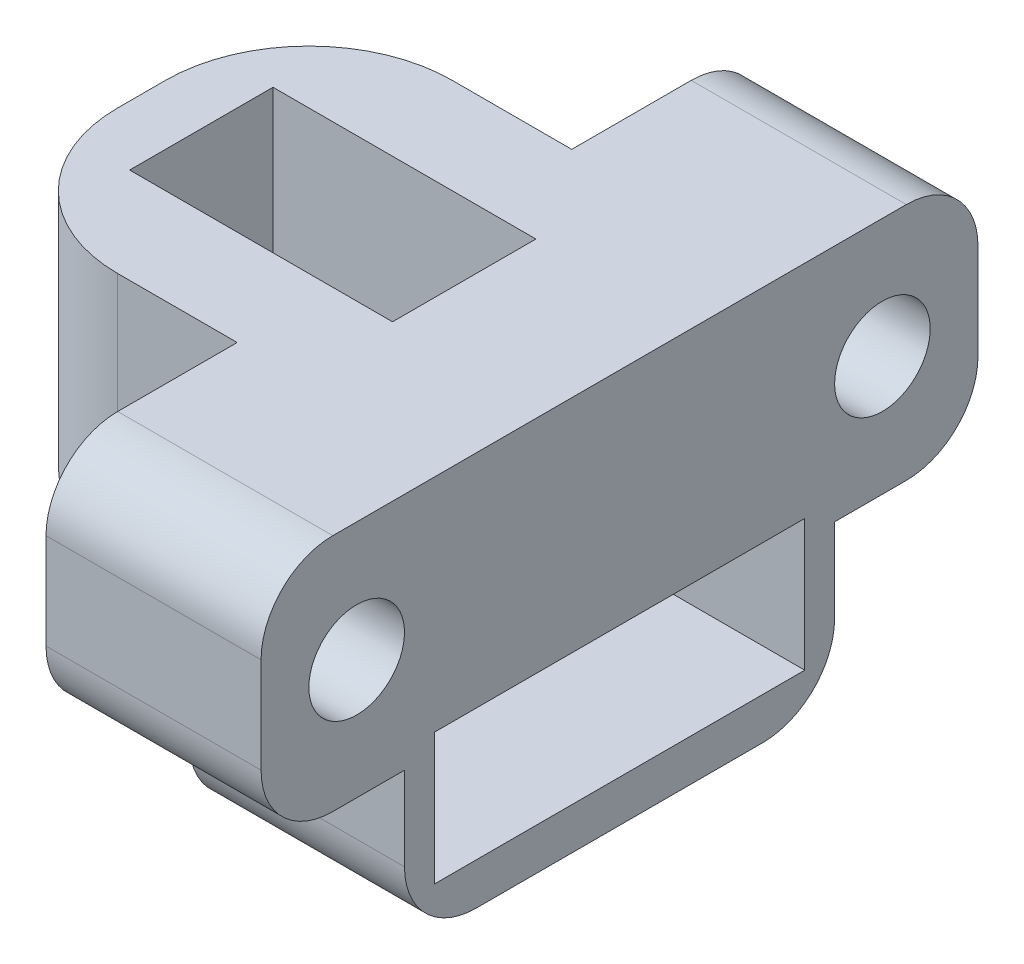
ISO-10303-21;
HEADER;
FILE_DESCRIPTION(('STEP AP214'),'2;1');
FILE_NAME('part.step','',(''),(''),'','','');
FILE_SCHEMA(('AUTOMOTIVE_DESIGN { 1 0 10303 214 1 1 1 1 }'));
ENDSEC;
DATA;
#1=APPLICATION_CONTEXT('core data for automotive mechanical design processes');
#2=APPLICATION_PROTOCOL_DEFINITION('international standard','automotive_design',2000,#1);
#3=PRODUCT_CONTEXT('',#1,'mechanical');
#4=PRODUCT('Part','Part','',(#3));
#5=PRODUCT_RELATED_PRODUCT_CATEGORY('part','',(#4));
#6=PRODUCT_DEFINITION_FORMATION('','',#4);
#7=PRODUCT_DEFINITION_CONTEXT('part definition',#1,'design');
#8=PRODUCT_DEFINITION('design','',#6,#7);
#9=PRODUCT_DEFINITION_SHAPE('','',#8);
#10=(LENGTH_UNIT() NAMED_UNIT(*) SI_UNIT(.MILLI.,.METRE.));
#11=(NAMED_UNIT(*) PLANE_ANGLE_UNIT() SI_UNIT($,.RADIAN.));
#12=(NAMED_UNIT(*) SI_UNIT($,.STERADIAN.) SOLID_ANGLE_UNIT());
#13=UNCERTAINTY_MEASURE_WITH_UNIT(LENGTH_MEASURE(1.E-05),#10,'distance_accuracy_value','');
#14=(GEOMETRIC_REPRESENTATION_CONTEXT(3) GLOBAL_UNCERTAINTY_ASSIGNED_CONTEXT((#13)) GLOBAL_UNIT_ASSIGNED_CONTEXT((#10,
#11,#12)) REPRESENTATION_CONTEXT('',''));
#15=CARTESIAN_POINT('',(0.,0.,0.));
#16=DIRECTION('',(0.,0.,1.));
#17=DIRECTION('',(1.,0.,0.));
#18=AXIS2_PLACEMENT_3D('',#15,#16,#17);
#19=CARTESIAN_POINT('',(10.,5.,-11.));
#20=DIRECTION('',(-1.,0.,0.));
#21=DIRECTION('',(0.,0.,1.));
#22=AXIS2_PLACEMENT_3D('',#19,#20,#21);
#23=CYLINDRICAL_SURFACE('',#22,2.);
#24=CARTESIAN_POINT('',(10.,5.,-11.));
#25=DIRECTION('',(-1.,0.,0.));
#26=DIRECTION('',(0.,0.,1.));
#27=AXIS2_PLACEMENT_3D('',#24,#25,#26);
#28=CIRCLE('',#27,2.);
#29=CARTESIAN_POINT('',(10.,5.,-9.));
#30=VERTEX_POINT('',#29);
#31=EDGE_CURVE('E253',#30,#30,#28,.T.);
#32=ORIENTED_EDGE('',*,*,#31,.F.);
#33=EDGE_LOOP('',(#32));
#34=FACE_BOUND('',#33,.T.);
#35=CARTESIAN_POINT('',(3.,5.,-11.));
#36=DIRECTION('',(-1.,0.,0.));
#37=DIRECTION('',(0.,0.,1.));
#38=AXIS2_PLACEMENT_3D('',#35,#36,#37);
#39=CIRCLE('',#38,2.);
#40=CARTESIAN_POINT('',(3.,5.,-9.));
#41=VERTEX_POINT('',#40);
#42=EDGE_CURVE('E379',#41,#41,#39,.F.);
#43=ORIENTED_EDGE('',*,*,#42,.F.);
#44=EDGE_LOOP('',(#43));
#45=FACE_BOUND('',#44,.T.);
#46=ADVANCED_FACE('F37',(#34,#45),#23,.F.);
#47=CARTESIAN_POINT('',(10.,5.,11.));
#48=DIRECTION('',(-1.,0.,0.));
#49=DIRECTION('',(0.,0.,1.));
#50=AXIS2_PLACEMENT_3D('',#47,#48,#49);
#51=CYLINDRICAL_SURFACE('',#50,2.);
#52=CARTESIAN_POINT('',(10.,5.,11.));
#53=DIRECTION('',(-1.,0.,0.));
#54=DIRECTION('',(0.,0.,1.));
#55=AXIS2_PLACEMENT_3D('',#52,#53,#54);
#56=CIRCLE('',#55,2.);
#57=CARTESIAN_POINT('',(10.,5.,13.));
#58=VERTEX_POINT('',#57);
#59=EDGE_CURVE('E260',#58,#58,#56,.T.);
#60=ORIENTED_EDGE('',*,*,#59,.F.);
#61=EDGE_LOOP('',(#60));
#62=FACE_BOUND('',#61,.T.);
#63=CARTESIAN_POINT('',(3.,5.,11.));
#64=DIRECTION('',(-1.,0.,0.));
#65=DIRECTION('',(0.,0.,1.));
#66=AXIS2_PLACEMENT_3D('',#63,#64,#65);
#67=CIRCLE('',#66,2.);
#68=CARTESIAN_POINT('',(3.,5.,13.));
#69=VERTEX_POINT('',#68);
#70=EDGE_CURVE('E376',#69,#69,#67,.F.);
#71=ORIENTED_EDGE('',*,*,#70,.F.);
#72=EDGE_LOOP('',(#71));
#73=FACE_BOUND('',#72,.T.);
#74=ADVANCED_FACE('F541',(#62,#73),#51,.F.);
#75=CARTESIAN_POINT('',(0.,0.,0.));
#76=DIRECTION('',(0.,1.,0.));
#77=DIRECTION('',(0.,0.,1.));
#78=AXIS2_PLACEMENT_3D('',#75,#76,#77);
#79=PLANE('',#78);
#80=DIRECTION('',(0.,0.,1.));
#81=VECTOR('',#80,1.);
#82=CARTESIAN_POINT('',(-10.,0.,-15.));
#83=LINE('',#82,#81);
#84=CARTESIAN_POINT('',(-10.,0.,-0.999999999999999));
#85=VERTEX_POINT('',#84);
#86=CARTESIAN_POINT('',(-10.,0.,1.));
#87=VERTEX_POINT('',#86);
#88=EDGE_CURVE('E363',#85,#87,#83,.T.);
#89=ORIENTED_EDGE('',*,*,#88,.F.);
#90=CARTESIAN_POINT('',(-4.,0.,-0.999999999999999));
#91=DIRECTION('',(0.,1.,0.));
#92=DIRECTION('',(0.,0.,1.));
#93=AXIS2_PLACEMENT_3D('',#90,#91,#92);
#94=CIRCLE('',#93,6.);
#95=CARTESIAN_POINT('',(-4.,0.,-7.));
#96=VERTEX_POINT('',#95);
#97=EDGE_CURVE('E396',#85,#96,#94,.F.);
#98=ORIENTED_EDGE('',*,*,#97,.T.);
#99=DIRECTION('',(1.,0.,0.));
#100=VECTOR('',#99,1.);
#101=CARTESIAN_POINT('',(-10.,0.,-7.));
#102=LINE('',#101,#100);
#103=CARTESIAN_POINT('',(0.999999999999999,0.,-7.));
#104=VERTEX_POINT('',#103);
#105=EDGE_CURVE('E327',#96,#104,#102,.T.);
#106=ORIENTED_EDGE('',*,*,#105,.T.);
#107=DIRECTION('',(0.,0.,-1.));
#108=VECTOR('',#107,1.);
#109=CARTESIAN_POINT('',(0.999999999999999,0.,9.));
#110=LINE('',#109,#108);
#111=CARTESIAN_POINT('',(1.,0.,7.));
#112=VERTEX_POINT('',#111);
#113=EDGE_CURVE('E278',#112,#104,#110,.T.);
#114=ORIENTED_EDGE('',*,*,#113,.F.);
#115=DIRECTION('',(-1.,0.,0.));
#116=VECTOR('',#115,1.);
#117=CARTESIAN_POINT('',(-10.,0.,7.));
#118=LINE('',#117,#116);
#119=CARTESIAN_POINT('',(-4.,0.,7.));
#120=VERTEX_POINT('',#119);
#121=EDGE_CURVE('E347',#112,#120,#118,.T.);
#122=ORIENTED_EDGE('',*,*,#121,.T.);
#123=CARTESIAN_POINT('',(-4.,0.,1.));
#124=DIRECTION('',(0.,1.,0.));
#125=DIRECTION('',(0.,0.,1.));
#126=AXIS2_PLACEMENT_3D('',#123,#124,#125);
#127=CIRCLE('',#126,6.);
#128=EDGE_CURVE('E394',#120,#87,#127,.F.);
#129=ORIENTED_EDGE('',*,*,#128,.T.);
#130=EDGE_LOOP('',(#89,#98,#106,#114,#122,#129));
#131=FACE_BOUND('',#130,.T.);
#132=ADVANCED_FACE('F512',(#131),#79,.F.);
#133=DIRECTION('',(0.,0.,-1.));
#134=VECTOR('',#133,1.);
#135=CARTESIAN_POINT('',(10.,0.,-15.));
#136=LINE('',#135,#134);
#137=CARTESIAN_POINT('',(10.,0.,12.));
#138=VERTEX_POINT('',#137);
#139=CARTESIAN_POINT('',(10.,0.,9.));
#140=VERTEX_POINT('',#139);
#141=EDGE_CURVE('E367',#138,#140,#136,.T.);
#142=ORIENTED_EDGE('',*,*,#141,.F.);
#143=DIRECTION('',(1.,0.,0.));
#144=VECTOR('',#143,1.);
#145=CARTESIAN_POINT('',(0.,0.,12.));
#146=LINE('',#145,#144);
#147=CARTESIAN_POINT('',(1.,0.,12.));
#148=VERTEX_POINT('',#147);
#149=EDGE_CURVE('E52',#138,#148,#146,.F.);
#150=ORIENTED_EDGE('',*,*,#149,.T.);
#151=DIRECTION('',(0.,0.,-1.));
#152=VECTOR('',#151,1.);
#153=CARTESIAN_POINT('',(1.,0.,15.));
#154=LINE('',#153,#152);
#155=CARTESIAN_POINT('',(1.,0.,9.));
#156=VERTEX_POINT('',#155);
#157=EDGE_CURVE('E345',#148,#156,#154,.T.);
#158=ORIENTED_EDGE('',*,*,#157,.T.);
#159=DIRECTION('',(-1.,0.,0.));
#160=VECTOR('',#159,1.);
#161=CARTESIAN_POINT('',(10.,0.,9.));
#162=LINE('',#161,#160);
#163=EDGE_CURVE('E274',#140,#156,#162,.T.);
#164=ORIENTED_EDGE('',*,*,#163,.F.);
#165=EDGE_LOOP('',(#142,#150,#158,#164));
#166=FACE_BOUND('',#165,.T.);
#167=ADVANCED_FACE('F534',(#166),#79,.F.);
#168=DIRECTION('',(0.,0.,-1.));
#169=VECTOR('',#168,1.);
#170=CARTESIAN_POINT('',(0.999999999999997,0.,-15.));
#171=LINE('',#170,#169);
#172=CARTESIAN_POINT('',(0.999999999999998,0.,-9.));
#173=VERTEX_POINT('',#172);
#174=CARTESIAN_POINT('',(0.999999999999998,0.,-12.));
#175=VERTEX_POINT('',#174);
#176=EDGE_CURVE('E329',#173,#175,#171,.T.);
#177=ORIENTED_EDGE('',*,*,#176,.T.);
#178=DIRECTION('',(-1.,0.,0.));
#179=VECTOR('',#178,1.);
#180=CARTESIAN_POINT('',(0.,0.,-12.));
#181=LINE('',#180,#179);
#182=CARTESIAN_POINT('',(10.,0.,-12.));
#183=VERTEX_POINT('',#182);
#184=EDGE_CURVE('E439',#175,#183,#181,.F.);
#185=ORIENTED_EDGE('',*,*,#184,.T.);
#186=CARTESIAN_POINT('',(10.,0.,-9.));
#187=VERTEX_POINT('',#186);
#188=EDGE_CURVE('E342',#187,#183,#136,.T.);
#189=ORIENTED_EDGE('',*,*,#188,.F.);
#190=DIRECTION('',(1.,0.,0.));
#191=VECTOR('',#190,1.);
#192=CARTESIAN_POINT('',(10.,0.,-9.));
#193=LINE('',#192,#191);
#194=EDGE_CURVE('E266',#173,#187,#193,.T.);
#195=ORIENTED_EDGE('',*,*,#194,.F.);
#196=EDGE_LOOP('',(#177,#185,#189,#195));
#197=FACE_BOUND('',#196,.T.);
#198=ADVANCED_FACE('F476',(#197),#79,.F.);
#199=CARTESIAN_POINT('',(10.,10.,-15.));
#200=DIRECTION('',(-1.,0.,0.));
#201=DIRECTION('',(0.,0.,1.));
#202=AXIS2_PLACEMENT_3D('',#199,#200,#201);
#203=PLANE('',#202);
#204=ORIENTED_EDGE('',*,*,#59,.T.);
#205=EDGE_LOOP('',(#204));
#206=FACE_BOUND('',#205,.T.);
#207=ORIENTED_EDGE('',*,*,#31,.T.);
#208=EDGE_LOOP('',(#207));
#209=FACE_BOUND('',#208,.T.);
#210=DIRECTION('',(0.,0.,-1.));
#211=VECTOR('',#210,1.);
#212=CARTESIAN_POINT('',(10.,-4.75,-7.75));
#213=LINE('',#212,#211);
#214=CARTESIAN_POINT('',(10.,-4.75,7.75));
#215=VERTEX_POINT('',#214);
#216=CARTESIAN_POINT('',(10.,-4.75,-7.75));
#217=VERTEX_POINT('',#216);
#218=EDGE_CURVE('E259',#215,#217,#213,.T.);
#219=ORIENTED_EDGE('',*,*,#218,.F.);
#220=DIRECTION('',(0.,-1.,0.));
#221=VECTOR('',#220,1.);
#222=CARTESIAN_POINT('',(10.,-4.75,7.75));
#223=LINE('',#222,#221);
#224=CARTESIAN_POINT('',(10.,0.749999999999999,7.75));
#225=VERTEX_POINT('',#224);
#226=EDGE_CURVE('E230',#225,#215,#223,.T.);
#227=ORIENTED_EDGE('',*,*,#226,.F.);
#228=DIRECTION('',(0.,0.,1.));
#229=VECTOR('',#228,1.);
#230=CARTESIAN_POINT('',(10.,0.750000000000001,-7.75));
#231=LINE('',#230,#229);
#232=CARTESIAN_POINT('',(10.,0.750000000000001,-7.75));
#233=VERTEX_POINT('',#232);
#234=EDGE_CURVE('E247',#233,#225,#231,.T.);
#235=ORIENTED_EDGE('',*,*,#234,.F.);
#236=DIRECTION('',(0.,1.,0.));
#237=VECTOR('',#236,1.);
#238=CARTESIAN_POINT('',(10.,-4.75,-7.75));
#239=LINE('',#238,#237);
#240=EDGE_CURVE('E250',#217,#233,#239,.T.);
#241=ORIENTED_EDGE('',*,*,#240,.F.);
#242=EDGE_LOOP('',(#219,#227,#235,#241));
#243=FACE_BOUND('',#242,.T.);
#244=DIRECTION('',(0.,0.,-1.));
#245=VECTOR('',#244,1.);
#246=CARTESIAN_POINT('',(10.,10.,-15.));
#247=LINE('',#246,#245);
#248=CARTESIAN_POINT('',(10.,10.,12.));
#249=VERTEX_POINT('',#248);
#250=CARTESIAN_POINT('',(10.,10.,-12.));
#251=VERTEX_POINT('',#250);
#252=EDGE_CURVE('E359',#249,#251,#247,.T.);
#253=ORIENTED_EDGE('',*,*,#252,.F.);
#254=CARTESIAN_POINT('',(10.,7.,12.));
#255=DIRECTION('',(-1.,0.,0.));
#256=DIRECTION('',(0.,0.,1.));
#257=AXIS2_PLACEMENT_3D('',#254,#255,#256);
#258=CIRCLE('',#257,3.);
#259=CARTESIAN_POINT('',(10.,7.,15.));
#260=VERTEX_POINT('',#259);
#261=EDGE_CURVE('E416',#249,#260,#258,.F.);
#262=ORIENTED_EDGE('',*,*,#261,.T.);
#263=DIRECTION('',(0.,-1.,0.));
#264=VECTOR('',#263,1.);
#265=CARTESIAN_POINT('',(10.,10.,15.));
#266=LINE('',#265,#264);
#267=CARTESIAN_POINT('',(10.,3.,15.));
#268=VERTEX_POINT('',#267);
#269=EDGE_CURVE('E366',#260,#268,#266,.T.);
#270=ORIENTED_EDGE('',*,*,#269,.T.);
#271=CARTESIAN_POINT('',(10.,3.,12.));
#272=DIRECTION('',(-1.,0.,0.));
#273=DIRECTION('',(0.,0.,1.));
#274=AXIS2_PLACEMENT_3D('',#271,#272,#273);
#275=CIRCLE('',#274,3.);
#276=EDGE_CURVE('E410',#268,#138,#275,.F.);
#277=ORIENTED_EDGE('',*,*,#276,.T.);
#278=ORIENTED_EDGE('',*,*,#141,.T.);
#279=DIRECTION('',(0.,1.,0.));
#280=VECTOR('',#279,1.);
#281=CARTESIAN_POINT('',(10.,-6.5,9.));
#282=LINE('',#281,#280);
#283=CARTESIAN_POINT('',(10.,-3.5,9.));
#284=VERTEX_POINT('',#283);
#285=EDGE_CURVE('E288',#284,#140,#282,.T.);
#286=ORIENTED_EDGE('',*,*,#285,.F.);
#287=CARTESIAN_POINT('',(10.,-3.5,6.));
#288=DIRECTION('',(-1.,0.,0.));
#289=DIRECTION('',(0.,0.,1.));
#290=AXIS2_PLACEMENT_3D('',#287,#288,#289);
#291=CIRCLE('',#290,3.);
#292=CARTESIAN_POINT('',(10.,-6.5,6.));
#293=VERTEX_POINT('',#292);
#294=EDGE_CURVE('E408',#284,#293,#291,.F.);
#295=ORIENTED_EDGE('',*,*,#294,.T.);
#296=DIRECTION('',(0.,0.,1.));
#297=VECTOR('',#296,1.);
#298=CARTESIAN_POINT('',(10.,-6.5,9.));
#299=LINE('',#298,#297);
#300=CARTESIAN_POINT('',(10.,-6.5,-6.));
#301=VERTEX_POINT('',#300);
#302=EDGE_CURVE('E273',#301,#293,#299,.T.);
#303=ORIENTED_EDGE('',*,*,#302,.F.);
#304=CARTESIAN_POINT('',(10.,-3.5,-6.));
#305=DIRECTION('',(-1.,0.,0.));
#306=DIRECTION('',(0.,0.,1.));
#307=AXIS2_PLACEMENT_3D('',#304,#305,#306);
#308=CIRCLE('',#307,3.);
#309=CARTESIAN_POINT('',(10.,-3.5,-9.));
#310=VERTEX_POINT('',#309);
#311=EDGE_CURVE('E406',#301,#310,#308,.F.);
#312=ORIENTED_EDGE('',*,*,#311,.T.);
#313=DIRECTION('',(0.,1.,0.));
#314=VECTOR('',#313,1.);
#315=CARTESIAN_POINT('',(10.,-6.5,-9.));
#316=LINE('',#315,#314);
#317=EDGE_CURVE('E290',#310,#187,#316,.T.);
#318=ORIENTED_EDGE('',*,*,#317,.T.);
#319=ORIENTED_EDGE('',*,*,#188,.T.);
#320=CARTESIAN_POINT('',(10.,3.,-12.));
#321=DIRECTION('',(-1.,0.,0.));
#322=DIRECTION('',(0.,0.,1.));
#323=AXIS2_PLACEMENT_3D('',#320,#321,#322);
#324=CIRCLE('',#323,3.);
#325=CARTESIAN_POINT('',(10.,3.,-15.));
#326=VERTEX_POINT('',#325);
#327=EDGE_CURVE('E412',#183,#326,#324,.F.);
#328=ORIENTED_EDGE('',*,*,#327,.T.);
#329=DIRECTION('',(0.,-1.,0.));
#330=VECTOR('',#329,1.);
#331=CARTESIAN_POINT('',(10.,10.,-15.));
#332=LINE('',#331,#330);
#333=CARTESIAN_POINT('',(10.,7.,-15.));
#334=VERTEX_POINT('',#333);
#335=EDGE_CURVE('E282',#334,#326,#332,.T.);
#336=ORIENTED_EDGE('',*,*,#335,.F.);
#337=CARTESIAN_POINT('',(10.,7.,-12.));
#338=DIRECTION('',(-1.,0.,0.));
#339=DIRECTION('',(0.,0.,1.));
#340=AXIS2_PLACEMENT_3D('',#337,#338,#339);
#341=CIRCLE('',#340,3.);
#342=EDGE_CURVE('E414',#334,#251,#341,.F.);
#343=ORIENTED_EDGE('',*,*,#342,.T.);
#344=EDGE_LOOP('',(#253,#262,#270,#277,#278,#286,#295,#303,#312,#318,#319,#328,#336,#343));
#345=FACE_BOUND('',#344,.T.);
#346=ADVANCED_FACE('F455',(#206,#209,#243,#345),#203,.F.);
#347=CARTESIAN_POINT('',(-10.,10.,-15.));
#348=DIRECTION('',(0.,0.,1.));
#349=DIRECTION('',(1.,0.,0.));
#350=AXIS2_PLACEMENT_3D('',#347,#348,#349);
#351=PLANE('',#350);
#352=DIRECTION('',(0.,1.,0.));
#353=VECTOR('',#352,1.);
#354=CARTESIAN_POINT('',(0.999999999999997,0.,-15.));
#355=LINE('',#354,#353);
#356=CARTESIAN_POINT('',(0.999999999999997,3.,-15.));
#357=VERTEX_POINT('',#356);
#358=CARTESIAN_POINT('',(0.999999999999997,7.,-15.));
#359=VERTEX_POINT('',#358);
#360=EDGE_CURVE('E339',#357,#359,#355,.T.);
#361=ORIENTED_EDGE('',*,*,#360,.T.);
#362=DIRECTION('',(-1.,0.,0.));
#363=VECTOR('',#362,1.);
#364=CARTESIAN_POINT('',(10.,7.,-15.));
#365=LINE('',#364,#363);
#366=EDGE_CURVE('E437',#359,#334,#365,.F.);
#367=ORIENTED_EDGE('',*,*,#366,.T.);
#368=ORIENTED_EDGE('',*,*,#335,.T.);
#369=DIRECTION('',(-1.,0.,0.));
#370=VECTOR('',#369,1.);
#371=CARTESIAN_POINT('',(-10.,3.,-15.));
#372=LINE('',#371,#370);
#373=EDGE_CURVE('E434',#326,#357,#372,.T.);
#374=ORIENTED_EDGE('',*,*,#373,.T.);
#375=EDGE_LOOP('',(#361,#367,#368,#374));
#376=FACE_BOUND('',#375,.T.);
#377=ADVANCED_FACE('F484',(#376),#351,.F.);
#378=CARTESIAN_POINT('',(-10.,10.,-15.));
#379=DIRECTION('',(1.,0.,0.));
#380=DIRECTION('',(0.,0.,-1.));
#381=AXIS2_PLACEMENT_3D('',#378,#379,#380);
#382=PLANE('',#381);
#383=DIRECTION('',(0.,0.,1.));
#384=VECTOR('',#383,1.);
#385=CARTESIAN_POINT('',(-10.,10.,-15.));
#386=LINE('',#385,#384);
#387=CARTESIAN_POINT('',(-10.,10.,-0.999999999999999));
#388=VERTEX_POINT('',#387);
#389=CARTESIAN_POINT('',(-10.,10.,1.));
#390=VERTEX_POINT('',#389);
#391=EDGE_CURVE('E362',#388,#390,#386,.T.);
#392=ORIENTED_EDGE('',*,*,#391,.F.);
#393=DIRECTION('',(0.,1.,0.));
#394=VECTOR('',#393,1.);
#395=CARTESIAN_POINT('',(-10.,10.,-0.999999999999999));
#396=LINE('',#395,#394);
#397=EDGE_CURVE('E392',#388,#85,#396,.F.);
#398=ORIENTED_EDGE('',*,*,#397,.T.);
#399=ORIENTED_EDGE('',*,*,#88,.T.);
#400=DIRECTION('',(0.,1.,0.));
#401=VECTOR('',#400,1.);
#402=CARTESIAN_POINT('',(-10.,10.,1.));
#403=LINE('',#402,#401);
#404=EDGE_CURVE('E389',#87,#390,#403,.T.);
#405=ORIENTED_EDGE('',*,*,#404,.T.);
#406=EDGE_LOOP('',(#392,#398,#399,#405));
#407=FACE_BOUND('',#406,.T.);
#408=ADVANCED_FACE('F506',(#407),#382,.F.);
#409=CARTESIAN_POINT('',(-10.,10.,15.));
#410=DIRECTION('',(0.,0.,-1.));
#411=DIRECTION('',(-1.,0.,0.));
#412=AXIS2_PLACEMENT_3D('',#409,#410,#411);
#413=PLANE('',#412);
#414=ORIENTED_EDGE('',*,*,#269,.F.);
#415=DIRECTION('',(1.,0.,0.));
#416=VECTOR('',#415,1.);
#417=CARTESIAN_POINT('',(1.,7.,15.));
#418=LINE('',#417,#416);
#419=CARTESIAN_POINT('',(1.,7.,15.));
#420=VERTEX_POINT('',#419);
#421=EDGE_CURVE('E421',#260,#420,#418,.F.);
#422=ORIENTED_EDGE('',*,*,#421,.T.);
#423=DIRECTION('',(0.,1.,0.));
#424=VECTOR('',#423,1.);
#425=CARTESIAN_POINT('',(1.,0.,15.));
#426=LINE('',#425,#424);
#427=CARTESIAN_POINT('',(1.,3.,15.));
#428=VERTEX_POINT('',#427);
#429=EDGE_CURVE('E351',#428,#420,#426,.T.);
#430=ORIENTED_EDGE('',*,*,#429,.F.);
#431=DIRECTION('',(1.,0.,0.));
#432=VECTOR('',#431,1.);
#433=CARTESIAN_POINT('',(-10.,3.,15.));
#434=LINE('',#433,#432);
#435=EDGE_CURVE('E418',#428,#268,#434,.T.);
#436=ORIENTED_EDGE('',*,*,#435,.T.);
#437=EDGE_LOOP('',(#414,#422,#430,#436));
#438=FACE_BOUND('',#437,.T.);
#439=ADVANCED_FACE('F528',(#438),#413,.F.);
#440=CARTESIAN_POINT('',(0.,10.,0.));
#441=DIRECTION('',(0.,1.,0.));
#442=DIRECTION('',(0.,0.,1.));
#443=AXIS2_PLACEMENT_3D('',#440,#441,#442);
#444=PLANE('',#443);
#445=DIRECTION('',(0.,0.,1.));
#446=VECTOR('',#445,1.);
#447=CARTESIAN_POINT('',(-7.5,10.,-3.));
#448=LINE('',#447,#446);
#449=CARTESIAN_POINT('',(-7.5,10.,-3.));
#450=VERTEX_POINT('',#449);
#451=CARTESIAN_POINT('',(-7.5,10.,3.));
#452=VERTEX_POINT('',#451);
#453=EDGE_CURVE('E294',#450,#452,#448,.T.);
#454=ORIENTED_EDGE('',*,*,#453,.F.);
#455=DIRECTION('',(-1.,0.,0.));
#456=VECTOR('',#455,1.);
#457=CARTESIAN_POINT('',(3.5,10.,-3.));
#458=LINE('',#457,#456);
#459=CARTESIAN_POINT('',(3.5,10.,-3.));
#460=VERTEX_POINT('',#459);
#461=EDGE_CURVE('E299',#460,#450,#458,.T.);
#462=ORIENTED_EDGE('',*,*,#461,.F.);
#463=DIRECTION('',(0.,0.,-1.));
#464=VECTOR('',#463,1.);
#465=CARTESIAN_POINT('',(3.5,10.,-3.));
#466=LINE('',#465,#464);
#467=CARTESIAN_POINT('',(3.5,10.,3.));
#468=VERTEX_POINT('',#467);
#469=EDGE_CURVE('E313',#468,#460,#466,.T.);
#470=ORIENTED_EDGE('',*,*,#469,.F.);
#471=DIRECTION('',(1.,0.,0.));
#472=VECTOR('',#471,1.);
#473=CARTESIAN_POINT('',(3.5,10.,3.));
#474=LINE('',#473,#472);
#475=EDGE_CURVE('E310',#452,#468,#474,.T.);
#476=ORIENTED_EDGE('',*,*,#475,.F.);
#477=EDGE_LOOP('',(#454,#462,#470,#476));
#478=FACE_BOUND('',#477,.T.);
#479=DIRECTION('',(0.,0.,-1.));
#480=VECTOR('',#479,1.);
#481=CARTESIAN_POINT('',(1.,10.,15.));
#482=LINE('',#481,#480);
#483=CARTESIAN_POINT('',(1.,10.,12.));
#484=VERTEX_POINT('',#483);
#485=CARTESIAN_POINT('',(1.,10.,7.));
#486=VERTEX_POINT('',#485);
#487=EDGE_CURVE('E320',#484,#486,#482,.T.);
#488=ORIENTED_EDGE('',*,*,#487,.F.);
#489=DIRECTION('',(1.,0.,0.));
#490=VECTOR('',#489,1.);
#491=CARTESIAN_POINT('',(10.,10.,12.));
#492=LINE('',#491,#490);
#493=EDGE_CURVE('E403',#484,#249,#492,.T.);
#494=ORIENTED_EDGE('',*,*,#493,.T.);
#495=ORIENTED_EDGE('',*,*,#252,.T.);
#496=DIRECTION('',(-1.,0.,0.));
#497=VECTOR('',#496,1.);
#498=CARTESIAN_POINT('',(0.999999999999997,10.,-12.));
#499=LINE('',#498,#497);
#500=CARTESIAN_POINT('',(0.999999999999998,10.,-12.));
#501=VERTEX_POINT('',#500);
#502=EDGE_CURVE('E400',#251,#501,#499,.T.);
#503=ORIENTED_EDGE('',*,*,#502,.T.);
#504=DIRECTION('',(0.,0.,-1.));
#505=VECTOR('',#504,1.);
#506=CARTESIAN_POINT('',(0.999999999999997,10.,-15.));
#507=LINE('',#506,#505);
#508=CARTESIAN_POINT('',(0.999999999999999,10.,-7.));
#509=VERTEX_POINT('',#508);
#510=EDGE_CURVE('E330',#509,#501,#507,.T.);
#511=ORIENTED_EDGE('',*,*,#510,.F.);
#512=DIRECTION('',(1.,0.,0.));
#513=VECTOR('',#512,1.);
#514=CARTESIAN_POINT('',(-10.,10.,-7.));
#515=LINE('',#514,#513);
#516=CARTESIAN_POINT('',(-4.,10.,-7.));
#517=VERTEX_POINT('',#516);
#518=EDGE_CURVE('E334',#517,#509,#515,.T.);
#519=ORIENTED_EDGE('',*,*,#518,.F.);
#520=CARTESIAN_POINT('',(-4.,10.,-0.999999999999999));
#521=DIRECTION('',(0.,1.,0.));
#522=DIRECTION('',(0.,0.,1.));
#523=AXIS2_PLACEMENT_3D('',#520,#521,#522);
#524=CIRCLE('',#523,6.);
#525=EDGE_CURVE('E387',#517,#388,#524,.T.);
#526=ORIENTED_EDGE('',*,*,#525,.T.);
#527=ORIENTED_EDGE('',*,*,#391,.T.);
#528=CARTESIAN_POINT('',(-4.,10.,1.));
#529=DIRECTION('',(0.,1.,0.));
#530=DIRECTION('',(0.,0.,1.));
#531=AXIS2_PLACEMENT_3D('',#528,#529,#530);
#532=CIRCLE('',#531,6.);
#533=CARTESIAN_POINT('',(-4.,10.,7.));
#534=VERTEX_POINT('',#533);
#535=EDGE_CURVE('E385',#390,#534,#532,.T.);
#536=ORIENTED_EDGE('',*,*,#535,.T.);
#537=DIRECTION('',(-1.,0.,0.));
#538=VECTOR('',#537,1.);
#539=CARTESIAN_POINT('',(-10.,10.,7.));
#540=LINE('',#539,#538);
#541=EDGE_CURVE('E348',#486,#534,#540,.T.);
#542=ORIENTED_EDGE('',*,*,#541,.F.);
#543=EDGE_LOOP('',(#488,#494,#495,#503,#511,#519,#526,#527,#536,#542));
#544=FACE_BOUND('',#543,.T.);
#545=ADVANCED_FACE('F494',(#478,#544),#444,.T.);
#546=CARTESIAN_POINT('',(-10.,0.,7.));
#547=DIRECTION('',(0.,0.,-1.));
#548=DIRECTION('',(-1.,0.,0.));
#549=AXIS2_PLACEMENT_3D('',#546,#547,#548);
#550=PLANE('',#549);
#551=ORIENTED_EDGE('',*,*,#541,.T.);
#552=DIRECTION('',(0.,1.,0.));
#553=VECTOR('',#552,1.);
#554=CARTESIAN_POINT('',(-4.,0.,7.));
#555=LINE('',#554,#553);
#556=EDGE_CURVE('E398',#534,#120,#555,.F.);
#557=ORIENTED_EDGE('',*,*,#556,.T.);
#558=ORIENTED_EDGE('',*,*,#121,.F.);
#559=DIRECTION('',(0.,1.,0.));
#560=VECTOR('',#559,1.);
#561=CARTESIAN_POINT('',(1.,0.,7.));
#562=LINE('',#561,#560);
#563=EDGE_CURVE('E336',#112,#486,#562,.T.);
#564=ORIENTED_EDGE('',*,*,#563,.T.);
#565=EDGE_LOOP('',(#551,#557,#558,#564));
#566=FACE_BOUND('',#565,.T.);
#567=ADVANCED_FACE('F519',(#566),#550,.F.);
#568=CARTESIAN_POINT('',(0.999999999999997,0.,-15.));
#569=DIRECTION('',(1.,0.,0.));
#570=DIRECTION('',(0.,0.,-1.));
#571=AXIS2_PLACEMENT_3D('',#568,#569,#570);
#572=PLANE('',#571);
#573=CARTESIAN_POINT('',(1.,5.,11.));
#574=DIRECTION('',(-1.,0.,0.));
#575=DIRECTION('',(0.,0.,1.));
#576=AXIS2_PLACEMENT_3D('',#573,#574,#575);
#577=CIRCLE('',#576,3.5);
#578=CARTESIAN_POINT('',(1.,5.,14.5));
#579=VERTEX_POINT('',#578);
#580=EDGE_CURVE('E881',#579,#579,#577,.T.);
#581=ORIENTED_EDGE('',*,*,#580,.F.);
#582=EDGE_LOOP('',(#581));
#583=FACE_BOUND('',#582,.T.);
#584=CARTESIAN_POINT('',(0.999999999999998,5.,-11.));
#585=DIRECTION('',(-1.,0.,0.));
#586=DIRECTION('',(0.,0.,1.));
#587=AXIS2_PLACEMENT_3D('',#584,#585,#586);
#588=CIRCLE('',#587,3.5);
#589=CARTESIAN_POINT('',(0.999999999999998,5.,-7.5));
#590=VERTEX_POINT('',#589);
#591=EDGE_CURVE('E889',#590,#590,#588,.T.);
#592=ORIENTED_EDGE('',*,*,#591,.F.);
#593=EDGE_LOOP('',(#592));
#594=FACE_BOUND('',#593,.T.);
#595=ORIENTED_EDGE('',*,*,#429,.T.);
#596=CARTESIAN_POINT('',(1.,7.,12.));
#597=DIRECTION('',(1.,0.,0.));
#598=DIRECTION('',(0.,0.,-1.));
#599=AXIS2_PLACEMENT_3D('',#596,#597,#598);
#600=CIRCLE('',#599,3.);
#601=EDGE_CURVE('E432',#420,#484,#600,.F.);
#602=ORIENTED_EDGE('',*,*,#601,.T.);
#603=ORIENTED_EDGE('',*,*,#487,.T.);
#604=ORIENTED_EDGE('',*,*,#563,.F.);
#605=ORIENTED_EDGE('',*,*,#113,.T.);
#606=DIRECTION('',(0.,1.,0.));
#607=VECTOR('',#606,1.);
#608=CARTESIAN_POINT('',(0.999999999999999,0.,-7.));
#609=LINE('',#608,#607);
#610=EDGE_CURVE('E333',#104,#509,#609,.T.);
#611=ORIENTED_EDGE('',*,*,#610,.T.);
#612=ORIENTED_EDGE('',*,*,#510,.T.);
#613=CARTESIAN_POINT('',(0.999999999999998,7.,-12.));
#614=DIRECTION('',(1.,0.,0.));
#615=DIRECTION('',(0.,0.,-1.));
#616=AXIS2_PLACEMENT_3D('',#613,#614,#615);
#617=CIRCLE('',#616,3.);
#618=EDGE_CURVE('E430',#501,#359,#617,.F.);
#619=ORIENTED_EDGE('',*,*,#618,.T.);
#620=ORIENTED_EDGE('',*,*,#360,.F.);
#621=CARTESIAN_POINT('',(0.999999999999997,3.,-12.));
#622=DIRECTION('',(1.,0.,0.));
#623=DIRECTION('',(0.,0.,-1.));
#624=AXIS2_PLACEMENT_3D('',#621,#622,#623);
#625=CIRCLE('',#624,3.);
#626=EDGE_CURVE('E428',#357,#175,#625,.F.);
#627=ORIENTED_EDGE('',*,*,#626,.T.);
#628=ORIENTED_EDGE('',*,*,#176,.F.);
#629=DIRECTION('',(0.,1.,0.));
#630=VECTOR('',#629,1.);
#631=CARTESIAN_POINT('',(1.,-6.5,-9.));
#632=LINE('',#631,#630);
#633=CARTESIAN_POINT('',(1.,-3.5,-9.));
#634=VERTEX_POINT('',#633);
#635=EDGE_CURVE('E292',#634,#173,#632,.T.);
#636=ORIENTED_EDGE('',*,*,#635,.F.);
#637=CARTESIAN_POINT('',(0.999999999999999,-3.5,-6.));
#638=DIRECTION('',(1.,0.,0.));
#639=DIRECTION('',(0.,0.,-1.));
#640=AXIS2_PLACEMENT_3D('',#637,#638,#639);
#641=CIRCLE('',#640,3.);
#642=CARTESIAN_POINT('',(1.,-6.5,-6.));
#643=VERTEX_POINT('',#642);
#644=EDGE_CURVE('E423',#634,#643,#641,.F.);
#645=ORIENTED_EDGE('',*,*,#644,.T.);
#646=DIRECTION('',(0.,0.,-1.));
#647=VECTOR('',#646,1.);
#648=CARTESIAN_POINT('',(0.999999999999999,-6.5,9.));
#649=LINE('',#648,#647);
#650=CARTESIAN_POINT('',(1.,-6.5,6.));
#651=VERTEX_POINT('',#650);
#652=EDGE_CURVE('E270',#651,#643,#649,.T.);
#653=ORIENTED_EDGE('',*,*,#652,.F.);
#654=CARTESIAN_POINT('',(1.,-3.5,6.));
#655=DIRECTION('',(1.,0.,0.));
#656=DIRECTION('',(0.,0.,-1.));
#657=AXIS2_PLACEMENT_3D('',#654,#655,#656);
#658=CIRCLE('',#657,3.);
#659=CARTESIAN_POINT('',(0.999999999999999,-3.5,9.));
#660=VERTEX_POINT('',#659);
#661=EDGE_CURVE('E60',#651,#660,#658,.F.);
#662=ORIENTED_EDGE('',*,*,#661,.T.);
#663=DIRECTION('',(0.,1.,0.));
#664=VECTOR('',#663,1.);
#665=CARTESIAN_POINT('',(0.999999999999999,-6.5,9.));
#666=LINE('',#665,#664);
#667=EDGE_CURVE('E277',#660,#156,#666,.T.);
#668=ORIENTED_EDGE('',*,*,#667,.T.);
#669=ORIENTED_EDGE('',*,*,#157,.F.);
#670=CARTESIAN_POINT('',(1.,3.,12.));
#671=DIRECTION('',(1.,0.,0.));
#672=DIRECTION('',(0.,0.,-1.));
#673=AXIS2_PLACEMENT_3D('',#670,#671,#672);
#674=CIRCLE('',#673,3.);
#675=EDGE_CURVE('E426',#148,#428,#674,.F.);
#676=ORIENTED_EDGE('',*,*,#675,.T.);
#677=EDGE_LOOP('',(#595,#602,#603,#604,#605,#611,#612,#619,#620,#627,#628,#636,#645,#653,#662,
#668,#669,#676));
#678=FACE_BOUND('',#677,.T.);
#679=ADVANCED_FACE('F463',(#583,#594,#678),#572,.F.);
#680=CARTESIAN_POINT('',(-10.,0.,-7.));
#681=DIRECTION('',(0.,0.,1.));
#682=DIRECTION('',(1.,0.,0.));
#683=AXIS2_PLACEMENT_3D('',#680,#681,#682);
#684=PLANE('',#683);
#685=ORIENTED_EDGE('',*,*,#105,.F.);
#686=DIRECTION('',(0.,1.,0.));
#687=VECTOR('',#686,1.);
#688=CARTESIAN_POINT('',(-4.,0.,-7.));
#689=LINE('',#688,#687);
#690=EDGE_CURVE('E281',#96,#517,#689,.T.);
#691=ORIENTED_EDGE('',*,*,#690,.T.);
#692=ORIENTED_EDGE('',*,*,#518,.T.);
#693=ORIENTED_EDGE('',*,*,#610,.F.);
#694=EDGE_LOOP('',(#685,#691,#692,#693));
#695=FACE_BOUND('',#694,.T.);
#696=ADVANCED_FACE('F500',(#695),#684,.F.);
#697=CARTESIAN_POINT('',(-7.5,3.,-3.));
#698=DIRECTION('',(-1.,0.,0.));
#699=DIRECTION('',(0.,0.,1.));
#700=AXIS2_PLACEMENT_3D('',#697,#698,#699);
#701=PLANE('',#700);
#702=ORIENTED_EDGE('',*,*,#453,.T.);
#703=DIRECTION('',(0.,1.,0.));
#704=VECTOR('',#703,1.);
#705=CARTESIAN_POINT('',(-7.5,3.,3.));
#706=LINE('',#705,#704);
#707=CARTESIAN_POINT('',(-7.5,3.,3.));
#708=VERTEX_POINT('',#707);
#709=EDGE_CURVE('E308',#708,#452,#706,.T.);
#710=ORIENTED_EDGE('',*,*,#709,.F.);
#711=DIRECTION('',(0.,0.,1.));
#712=VECTOR('',#711,1.);
#713=CARTESIAN_POINT('',(-7.5,3.,-3.));
#714=LINE('',#713,#712);
#715=CARTESIAN_POINT('',(-7.5,3.,-3.));
#716=VERTEX_POINT('',#715);
#717=EDGE_CURVE('E295',#716,#708,#714,.T.);
#718=ORIENTED_EDGE('',*,*,#717,.F.);
#719=DIRECTION('',(0.,1.,0.));
#720=VECTOR('',#719,1.);
#721=CARTESIAN_POINT('',(-7.5,3.,-3.));
#722=LINE('',#721,#720);
#723=EDGE_CURVE('E318',#716,#450,#722,.T.);
#724=ORIENTED_EDGE('',*,*,#723,.T.);
#725=EDGE_LOOP('',(#702,#710,#718,#724));
#726=FACE_BOUND('',#725,.T.);
#727=ADVANCED_FACE('F586',(#726),#701,.F.);
#728=CARTESIAN_POINT('',(3.5,3.,-3.));
#729=DIRECTION('',(0.,0.,-1.));
#730=DIRECTION('',(-1.,0.,0.));
#731=AXIS2_PLACEMENT_3D('',#728,#729,#730);
#732=PLANE('',#731);
#733=ORIENTED_EDGE('',*,*,#461,.T.);
#734=ORIENTED_EDGE('',*,*,#723,.F.);
#735=DIRECTION('',(-1.,0.,0.));
#736=VECTOR('',#735,1.);
#737=CARTESIAN_POINT('',(3.5,3.,-3.));
#738=LINE('',#737,#736);
#739=CARTESIAN_POINT('',(3.5,3.,-3.));
#740=VERTEX_POINT('',#739);
#741=EDGE_CURVE('E305',#740,#716,#738,.T.);
#742=ORIENTED_EDGE('',*,*,#741,.F.);
#743=DIRECTION('',(0.,1.,0.));
#744=VECTOR('',#743,1.);
#745=CARTESIAN_POINT('',(3.5,3.,-3.));
#746=LINE('',#745,#744);
#747=EDGE_CURVE('E321',#740,#460,#746,.T.);
#748=ORIENTED_EDGE('',*,*,#747,.T.);
#749=EDGE_LOOP('',(#733,#734,#742,#748));
#750=FACE_BOUND('',#749,.T.);
#751=ADVANCED_FACE('F582',(#750),#732,.F.);
#752=CARTESIAN_POINT('',(3.5,3.,-3.));
#753=DIRECTION('',(1.,0.,0.));
#754=DIRECTION('',(0.,0.,-1.));
#755=AXIS2_PLACEMENT_3D('',#752,#753,#754);
#756=PLANE('',#755);
#757=ORIENTED_EDGE('',*,*,#469,.T.);
#758=ORIENTED_EDGE('',*,*,#747,.F.);
#759=DIRECTION('',(0.,0.,-1.));
#760=VECTOR('',#759,1.);
#761=CARTESIAN_POINT('',(3.5,3.,-3.));
#762=LINE('',#761,#760);
#763=CARTESIAN_POINT('',(3.5,3.,3.));
#764=VERTEX_POINT('',#763);
#765=EDGE_CURVE('E302',#764,#740,#762,.T.);
#766=ORIENTED_EDGE('',*,*,#765,.F.);
#767=DIRECTION('',(0.,1.,0.));
#768=VECTOR('',#767,1.);
#769=CARTESIAN_POINT('',(3.5,3.,3.));
#770=LINE('',#769,#768);
#771=EDGE_CURVE('E323',#764,#468,#770,.T.);
#772=ORIENTED_EDGE('',*,*,#771,.T.);
#773=EDGE_LOOP('',(#757,#758,#766,#772));
#774=FACE_BOUND('',#773,.T.);
#775=ADVANCED_FACE('F585',(#774),#756,.F.);
#776=CARTESIAN_POINT('',(3.5,3.,3.));
#777=DIRECTION('',(0.,0.,1.));
#778=DIRECTION('',(1.,0.,0.));
#779=AXIS2_PLACEMENT_3D('',#776,#777,#778);
#780=PLANE('',#779);
#781=ORIENTED_EDGE('',*,*,#475,.T.);
#782=ORIENTED_EDGE('',*,*,#771,.F.);
#783=DIRECTION('',(1.,0.,0.));
#784=VECTOR('',#783,1.);
#785=CARTESIAN_POINT('',(3.5,3.,3.));
#786=LINE('',#785,#784);
#787=EDGE_CURVE('E298',#708,#764,#786,.T.);
#788=ORIENTED_EDGE('',*,*,#787,.F.);
#789=ORIENTED_EDGE('',*,*,#709,.T.);
#790=EDGE_LOOP('',(#781,#782,#788,#789));
#791=FACE_BOUND('',#790,.T.);
#792=ADVANCED_FACE('F580',(#791),#780,.F.);
#793=CARTESIAN_POINT('',(0.,3.,0.));
#794=DIRECTION('',(0.,-1.,0.));
#795=DIRECTION('',(0.,0.,-1.));
#796=AXIS2_PLACEMENT_3D('',#793,#794,#795);
#797=PLANE('',#796);
#798=ORIENTED_EDGE('',*,*,#717,.T.);
#799=ORIENTED_EDGE('',*,*,#787,.T.);
#800=ORIENTED_EDGE('',*,*,#765,.T.);
#801=ORIENTED_EDGE('',*,*,#741,.T.);
#802=EDGE_LOOP('',(#798,#799,#800,#801));
#803=FACE_BOUND('',#802,.T.);
#804=ADVANCED_FACE('F577',(#803),#797,.F.);
#805=CARTESIAN_POINT('',(10.,-6.5,-9.));
#806=DIRECTION('',(0.,0.,1.));
#807=DIRECTION('',(1.,0.,0.));
#808=AXIS2_PLACEMENT_3D('',#805,#806,#807);
#809=PLANE('',#808);
#810=ORIENTED_EDGE('',*,*,#317,.F.);
#811=DIRECTION('',(1.,0.,0.));
#812=VECTOR('',#811,1.);
#813=CARTESIAN_POINT('',(10.,-3.5,-9.));
#814=LINE('',#813,#812);
#815=EDGE_CURVE('E11',#310,#634,#814,.F.);
#816=ORIENTED_EDGE('',*,*,#815,.T.);
#817=ORIENTED_EDGE('',*,*,#635,.T.);
#818=ORIENTED_EDGE('',*,*,#194,.T.);
#819=EDGE_LOOP('',(#810,#816,#817,#818));
#820=FACE_BOUND('',#819,.T.);
#821=ADVANCED_FACE('F473',(#820),#809,.F.);
#822=CARTESIAN_POINT('',(10.,-6.5,9.));
#823=DIRECTION('',(0.,0.,-1.));
#824=DIRECTION('',(-1.,0.,0.));
#825=AXIS2_PLACEMENT_3D('',#822,#823,#824);
#826=PLANE('',#825);
#827=ORIENTED_EDGE('',*,*,#667,.F.);
#828=DIRECTION('',(-1.,0.,0.));
#829=VECTOR('',#828,1.);
#830=CARTESIAN_POINT('',(10.,-3.5,9.));
#831=LINE('',#830,#829);
#832=EDGE_CURVE('E45',#660,#284,#831,.F.);
#833=ORIENTED_EDGE('',*,*,#832,.T.);
#834=ORIENTED_EDGE('',*,*,#285,.T.);
#835=ORIENTED_EDGE('',*,*,#163,.T.);
#836=EDGE_LOOP('',(#827,#833,#834,#835));
#837=FACE_BOUND('',#836,.T.);
#838=ADVANCED_FACE('F450',(#837),#826,.F.);
#839=CARTESIAN_POINT('',(0.,-6.5,0.));
#840=DIRECTION('',(0.,1.,0.));
#841=DIRECTION('',(0.,0.,1.));
#842=AXIS2_PLACEMENT_3D('',#839,#840,#841);
#843=PLANE('',#842);
#844=ORIENTED_EDGE('',*,*,#302,.T.);
#845=DIRECTION('',(-1.,0.,0.));
#846=VECTOR('',#845,1.);
#847=CARTESIAN_POINT('',(0.,-6.5,6.));
#848=LINE('',#847,#846);
#849=EDGE_CURVE('E445',#293,#651,#848,.T.);
#850=ORIENTED_EDGE('',*,*,#849,.T.);
#851=ORIENTED_EDGE('',*,*,#652,.T.);
#852=DIRECTION('',(1.,0.,0.));
#853=VECTOR('',#852,1.);
#854=CARTESIAN_POINT('',(0.,-6.5,-6.));
#855=LINE('',#854,#853);
#856=EDGE_CURVE('E442',#643,#301,#855,.T.);
#857=ORIENTED_EDGE('',*,*,#856,.T.);
#858=EDGE_LOOP('',(#844,#850,#851,#857));
#859=FACE_BOUND('',#858,.T.);
#860=ADVANCED_FACE('F461',(#859),#843,.F.);
#861=CARTESIAN_POINT('',(2.5,-4.75,7.75));
#862=DIRECTION('',(0.,0.,1.));
#863=DIRECTION('',(1.,0.,0.));
#864=AXIS2_PLACEMENT_3D('',#861,#862,#863);
#865=PLANE('',#864);
#866=ORIENTED_EDGE('',*,*,#226,.T.);
#867=DIRECTION('',(1.,0.,0.));
#868=VECTOR('',#867,1.);
#869=CARTESIAN_POINT('',(2.5,-4.75,7.75));
#870=LINE('',#869,#868);
#871=CARTESIAN_POINT('',(2.5,-4.75,7.75));
#872=VERTEX_POINT('',#871);
#873=EDGE_CURVE('E223',#872,#215,#870,.T.);
#874=ORIENTED_EDGE('',*,*,#873,.F.);
#875=DIRECTION('',(0.,-1.,0.));
#876=VECTOR('',#875,1.);
#877=CARTESIAN_POINT('',(2.5,-4.75,7.75));
#878=LINE('',#877,#876);
#879=CARTESIAN_POINT('',(2.5,0.749999999999999,7.75));
#880=VERTEX_POINT('',#879);
#881=EDGE_CURVE('E227',#880,#872,#878,.T.);
#882=ORIENTED_EDGE('',*,*,#881,.F.);
#883=DIRECTION('',(1.,0.,0.));
#884=VECTOR('',#883,1.);
#885=CARTESIAN_POINT('',(2.5,0.749999999999999,7.75));
#886=LINE('',#885,#884);
#887=EDGE_CURVE('E264',#880,#225,#886,.T.);
#888=ORIENTED_EDGE('',*,*,#887,.T.);
#889=EDGE_LOOP('',(#866,#874,#882,#888));
#890=FACE_BOUND('',#889,.T.);
#891=ADVANCED_FACE('F225',(#890),#865,.F.);
#892=CARTESIAN_POINT('',(2.5,0.750000000000001,-7.75));
#893=DIRECTION('',(0.,1.,0.));
#894=DIRECTION('',(0.,0.,1.));
#895=AXIS2_PLACEMENT_3D('',#892,#893,#894);
#896=PLANE('',#895);
#897=ORIENTED_EDGE('',*,*,#234,.T.);
#898=ORIENTED_EDGE('',*,*,#887,.F.);
#899=DIRECTION('',(0.,0.,1.));
#900=VECTOR('',#899,1.);
#901=CARTESIAN_POINT('',(2.5,0.750000000000001,-7.75));
#902=LINE('',#901,#900);
#903=CARTESIAN_POINT('',(2.5,0.750000000000001,-7.75));
#904=VERTEX_POINT('',#903);
#905=EDGE_CURVE('E235',#904,#880,#902,.T.);
#906=ORIENTED_EDGE('',*,*,#905,.F.);
#907=DIRECTION('',(1.,0.,0.));
#908=VECTOR('',#907,1.);
#909=CARTESIAN_POINT('',(2.5,0.750000000000001,-7.75));
#910=LINE('',#909,#908);
#911=EDGE_CURVE('E267',#904,#233,#910,.T.);
#912=ORIENTED_EDGE('',*,*,#911,.T.);
#913=EDGE_LOOP('',(#897,#898,#906,#912));
#914=FACE_BOUND('',#913,.T.);
#915=ADVANCED_FACE('F559',(#914),#896,.F.);
#916=CARTESIAN_POINT('',(2.5,-4.75,-7.75));
#917=DIRECTION('',(0.,0.,-1.));
#918=DIRECTION('',(-1.,0.,0.));
#919=AXIS2_PLACEMENT_3D('',#916,#917,#918);
#920=PLANE('',#919);
#921=ORIENTED_EDGE('',*,*,#240,.T.);
#922=ORIENTED_EDGE('',*,*,#911,.F.);
#923=DIRECTION('',(0.,1.,0.));
#924=VECTOR('',#923,1.);
#925=CARTESIAN_POINT('',(2.5,-4.75,-7.75));
#926=LINE('',#925,#924);
#927=CARTESIAN_POINT('',(2.5,-4.75,-7.75));
#928=VERTEX_POINT('',#927);
#929=EDGE_CURVE('E243',#928,#904,#926,.T.);
#930=ORIENTED_EDGE('',*,*,#929,.F.);
#931=DIRECTION('',(1.,0.,0.));
#932=VECTOR('',#931,1.);
#933=CARTESIAN_POINT('',(2.5,-4.75,-7.75));
#934=LINE('',#933,#932);
#935=EDGE_CURVE('E234',#928,#217,#934,.T.);
#936=ORIENTED_EDGE('',*,*,#935,.T.);
#937=EDGE_LOOP('',(#921,#922,#930,#936));
#938=FACE_BOUND('',#937,.T.);
#939=ADVANCED_FACE('F562',(#938),#920,.F.);
#940=CARTESIAN_POINT('',(2.5,-4.75,-7.75));
#941=DIRECTION('',(0.,-1.,0.));
#942=DIRECTION('',(0.,0.,-1.));
#943=AXIS2_PLACEMENT_3D('',#940,#941,#942);
#944=PLANE('',#943);
#945=ORIENTED_EDGE('',*,*,#218,.T.);
#946=ORIENTED_EDGE('',*,*,#935,.F.);
#947=DIRECTION('',(0.,0.,-1.));
#948=VECTOR('',#947,1.);
#949=CARTESIAN_POINT('',(2.5,-4.75,-7.75));
#950=LINE('',#949,#948);
#951=EDGE_CURVE('E238',#872,#928,#950,.T.);
#952=ORIENTED_EDGE('',*,*,#951,.F.);
#953=ORIENTED_EDGE('',*,*,#873,.T.);
#954=EDGE_LOOP('',(#945,#946,#952,#953));
#955=FACE_BOUND('',#954,.T.);
#956=ADVANCED_FACE('F239',(#955),#944,.F.);
#957=CARTESIAN_POINT('',(2.5,0.,0.));
#958=DIRECTION('',(1.,0.,0.));
#959=DIRECTION('',(0.,0.,-1.));
#960=AXIS2_PLACEMENT_3D('',#957,#958,#959);
#961=PLANE('',#960);
#962=ORIENTED_EDGE('',*,*,#881,.T.);
#963=ORIENTED_EDGE('',*,*,#951,.T.);
#964=ORIENTED_EDGE('',*,*,#929,.T.);
#965=ORIENTED_EDGE('',*,*,#905,.T.);
#966=EDGE_LOOP('',(#962,#963,#964,#965));
#967=FACE_BOUND('',#966,.T.);
#968=ADVANCED_FACE('F245',(#967),#961,.T.);
#969=CARTESIAN_POINT('',(3.,5.,11.));
#970=DIRECTION('',(-1.,0.,0.));
#971=DIRECTION('',(0.,0.,1.));
#972=AXIS2_PLACEMENT_3D('',#969,#970,#971);
#973=PLANE('',#972);
#974=CARTESIAN_POINT('',(3.,5.,11.));
#975=DIRECTION('',(-1.,0.,0.));
#976=DIRECTION('',(0.,0.,1.));
#977=AXIS2_PLACEMENT_3D('',#974,#975,#976);
#978=CIRCLE('',#977,3.5);
#979=CARTESIAN_POINT('',(3.,5.,14.5));
#980=VERTEX_POINT('',#979);
#981=EDGE_CURVE('E380',#980,#980,#978,.T.);
#982=ORIENTED_EDGE('',*,*,#981,.T.);
#983=EDGE_LOOP('',(#982));
#984=FACE_BOUND('',#983,.T.);
#985=ORIENTED_EDGE('',*,*,#70,.T.);
#986=EDGE_LOOP('',(#985));
#987=FACE_BOUND('',#986,.T.);
#988=ADVANCED_FACE('F558',(#984,#987),#973,.T.);
#989=CARTESIAN_POINT('',(3.,5.,11.));
#990=DIRECTION('',(-1.,0.,0.));
#991=DIRECTION('',(0.,0.,1.));
#992=AXIS2_PLACEMENT_3D('',#989,#990,#991);
#993=CYLINDRICAL_SURFACE('',#992,3.5);
#994=ORIENTED_EDGE('',*,*,#981,.F.);
#995=EDGE_LOOP('',(#994));
#996=FACE_BOUND('',#995,.T.);
#997=ORIENTED_EDGE('',*,*,#580,.T.);
#998=EDGE_LOOP('',(#997));
#999=FACE_BOUND('',#998,.T.);
#1000=ADVANCED_FACE('F786',(#996,#999),#993,.F.);
#1001=CARTESIAN_POINT('',(3.,5.,-11.));
#1002=DIRECTION('',(-1.,0.,0.));
#1003=DIRECTION('',(0.,0.,1.));
#1004=AXIS2_PLACEMENT_3D('',#1001,#1002,#1003);
#1005=PLANE('',#1004);
#1006=CARTESIAN_POINT('',(3.,5.,-11.));
#1007=DIRECTION('',(-1.,0.,0.));
#1008=DIRECTION('',(0.,0.,1.));
#1009=AXIS2_PLACEMENT_3D('',#1006,#1007,#1008);
#1010=CIRCLE('',#1009,3.5);
#1011=CARTESIAN_POINT('',(3.,5.,-7.5));
#1012=VERTEX_POINT('',#1011);
#1013=EDGE_CURVE('E884',#1012,#1012,#1010,.T.);
#1014=ORIENTED_EDGE('',*,*,#1013,.T.);
#1015=EDGE_LOOP('',(#1014));
#1016=FACE_BOUND('',#1015,.T.);
#1017=ORIENTED_EDGE('',*,*,#42,.T.);
#1018=EDGE_LOOP('',(#1017));
#1019=FACE_BOUND('',#1018,.T.);
#1020=ADVANCED_FACE('F777',(#1016,#1019),#1005,.T.);
#1021=CARTESIAN_POINT('',(3.,5.,-11.));
#1022=DIRECTION('',(-1.,0.,0.));
#1023=DIRECTION('',(0.,0.,1.));
#1024=AXIS2_PLACEMENT_3D('',#1021,#1022,#1023);
#1025=CYLINDRICAL_SURFACE('',#1024,3.5);
#1026=ORIENTED_EDGE('',*,*,#1013,.F.);
#1027=EDGE_LOOP('',(#1026));
#1028=FACE_BOUND('',#1027,.T.);
#1029=ORIENTED_EDGE('',*,*,#591,.T.);
#1030=EDGE_LOOP('',(#1029));
#1031=FACE_BOUND('',#1030,.T.);
#1032=ADVANCED_FACE('F628',(#1028,#1031),#1025,.F.);
#1033=CARTESIAN_POINT('',(-4.,0.,-0.999999999999999));
#1034=DIRECTION('',(0.,1.,0.));
#1035=DIRECTION('',(0.,0.,1.));
#1036=AXIS2_PLACEMENT_3D('',#1033,#1034,#1035);
#1037=CYLINDRICAL_SURFACE('',#1036,6.);
#1038=ORIENTED_EDGE('',*,*,#97,.F.);
#1039=ORIENTED_EDGE('',*,*,#397,.F.);
#1040=ORIENTED_EDGE('',*,*,#525,.F.);
#1041=ORIENTED_EDGE('',*,*,#690,.F.);
#1042=EDGE_LOOP('',(#1038,#1039,#1040,#1041));
#1043=FACE_BOUND('',#1042,.T.);
#1044=ADVANCED_FACE('F510',(#1043),#1037,.T.);
#1045=CARTESIAN_POINT('',(-4.,10.,1.));
#1046=DIRECTION('',(0.,1.,0.));
#1047=DIRECTION('',(0.,0.,1.));
#1048=AXIS2_PLACEMENT_3D('',#1045,#1046,#1047);
#1049=CYLINDRICAL_SURFACE('',#1048,6.);
#1050=ORIENTED_EDGE('',*,*,#128,.F.);
#1051=ORIENTED_EDGE('',*,*,#556,.F.);
#1052=ORIENTED_EDGE('',*,*,#535,.F.);
#1053=ORIENTED_EDGE('',*,*,#404,.F.);
#1054=EDGE_LOOP('',(#1050,#1051,#1052,#1053));
#1055=FACE_BOUND('',#1054,.T.);
#1056=ADVANCED_FACE('F515',(#1055),#1049,.T.);
#1057=CARTESIAN_POINT('',(0.,7.,12.));
#1058=DIRECTION('',(-1.,0.,0.));
#1059=DIRECTION('',(0.,0.,1.));
#1060=AXIS2_PLACEMENT_3D('',#1057,#1058,#1059);
#1061=CYLINDRICAL_SURFACE('',#1060,3.);
#1062=ORIENTED_EDGE('',*,*,#601,.F.);
#1063=ORIENTED_EDGE('',*,*,#421,.F.);
#1064=ORIENTED_EDGE('',*,*,#261,.F.);
#1065=ORIENTED_EDGE('',*,*,#493,.F.);
#1066=EDGE_LOOP('',(#1062,#1063,#1064,#1065));
#1067=FACE_BOUND('',#1066,.T.);
#1068=ADVANCED_FACE('F524',(#1067),#1061,.T.);
#1069=CARTESIAN_POINT('',(0.,7.,-12.));
#1070=DIRECTION('',(1.,0.,0.));
#1071=DIRECTION('',(0.,0.,-1.));
#1072=AXIS2_PLACEMENT_3D('',#1069,#1070,#1071);
#1073=CYLINDRICAL_SURFACE('',#1072,3.);
#1074=ORIENTED_EDGE('',*,*,#342,.F.);
#1075=ORIENTED_EDGE('',*,*,#366,.F.);
#1076=ORIENTED_EDGE('',*,*,#618,.F.);
#1077=ORIENTED_EDGE('',*,*,#502,.F.);
#1078=EDGE_LOOP('',(#1074,#1075,#1076,#1077));
#1079=FACE_BOUND('',#1078,.T.);
#1080=ADVANCED_FACE('F490',(#1079),#1073,.T.);
#1081=CARTESIAN_POINT('',(-10.,3.,-12.));
#1082=DIRECTION('',(-1.,0.,0.));
#1083=DIRECTION('',(0.,0.,1.));
#1084=AXIS2_PLACEMENT_3D('',#1081,#1082,#1083);
#1085=CYLINDRICAL_SURFACE('',#1084,3.);
#1086=ORIENTED_EDGE('',*,*,#327,.F.);
#1087=ORIENTED_EDGE('',*,*,#184,.F.);
#1088=ORIENTED_EDGE('',*,*,#626,.F.);
#1089=ORIENTED_EDGE('',*,*,#373,.F.);
#1090=EDGE_LOOP('',(#1086,#1087,#1088,#1089));
#1091=FACE_BOUND('',#1090,.T.);
#1092=ADVANCED_FACE('F482',(#1091),#1085,.T.);
#1093=CARTESIAN_POINT('',(-10.,3.,12.));
#1094=DIRECTION('',(1.,0.,0.));
#1095=DIRECTION('',(0.,0.,-1.));
#1096=AXIS2_PLACEMENT_3D('',#1093,#1094,#1095);
#1097=CYLINDRICAL_SURFACE('',#1096,3.);
#1098=ORIENTED_EDGE('',*,*,#675,.F.);
#1099=ORIENTED_EDGE('',*,*,#149,.F.);
#1100=ORIENTED_EDGE('',*,*,#276,.F.);
#1101=ORIENTED_EDGE('',*,*,#435,.F.);
#1102=EDGE_LOOP('',(#1098,#1099,#1100,#1101));
#1103=FACE_BOUND('',#1102,.T.);
#1104=ADVANCED_FACE('F533',(#1103),#1097,.T.);
#1105=CARTESIAN_POINT('',(0.,-3.5,6.));
#1106=DIRECTION('',(-1.,0.,0.));
#1107=DIRECTION('',(0.,0.,1.));
#1108=AXIS2_PLACEMENT_3D('',#1105,#1106,#1107);
#1109=CYLINDRICAL_SURFACE('',#1108,3.);
#1110=ORIENTED_EDGE('',*,*,#294,.F.);
#1111=ORIENTED_EDGE('',*,*,#832,.F.);
#1112=ORIENTED_EDGE('',*,*,#661,.F.);
#1113=ORIENTED_EDGE('',*,*,#849,.F.);
#1114=EDGE_LOOP('',(#1110,#1111,#1112,#1113));
#1115=FACE_BOUND('',#1114,.T.);
#1116=ADVANCED_FACE('F459',(#1115),#1109,.T.);
#1117=CARTESIAN_POINT('',(0.,-3.5,-6.));
#1118=DIRECTION('',(1.,0.,0.));
#1119=DIRECTION('',(0.,0.,-1.));
#1120=AXIS2_PLACEMENT_3D('',#1117,#1118,#1119);
#1121=CYLINDRICAL_SURFACE('',#1120,3.);
#1122=ORIENTED_EDGE('',*,*,#644,.F.);
#1123=ORIENTED_EDGE('',*,*,#815,.F.);
#1124=ORIENTED_EDGE('',*,*,#311,.F.);
#1125=ORIENTED_EDGE('',*,*,#856,.F.);
#1126=EDGE_LOOP('',(#1122,#1123,#1124,#1125));
#1127=FACE_BOUND('',#1126,.T.);
#1128=ADVANCED_FACE('F39',(#1127),#1121,.T.);
#1129=CLOSED_SHELL('',(#46,#74,#132,#167,#198,#346,#377,#408,#439,#545,#567,#679,#696,#727,#751,
#775,#792,#804,#821,#838,#860,#891,#915,#939,#956,#968,#988,#1000,#1020,#1032,#1044,#1056,#1068,
#1080,#1092,#1104,#1116,#1128));
#1130=MANIFOLD_SOLID_BREP('B2',#1129);
#1131=ADVANCED_BREP_SHAPE_REPRESENTATION('',(#18,#1130),#14);
#1132=SHAPE_DEFINITION_REPRESENTATION(#9,#1131);
ENDSEC;
END-ISO-10303-21;
